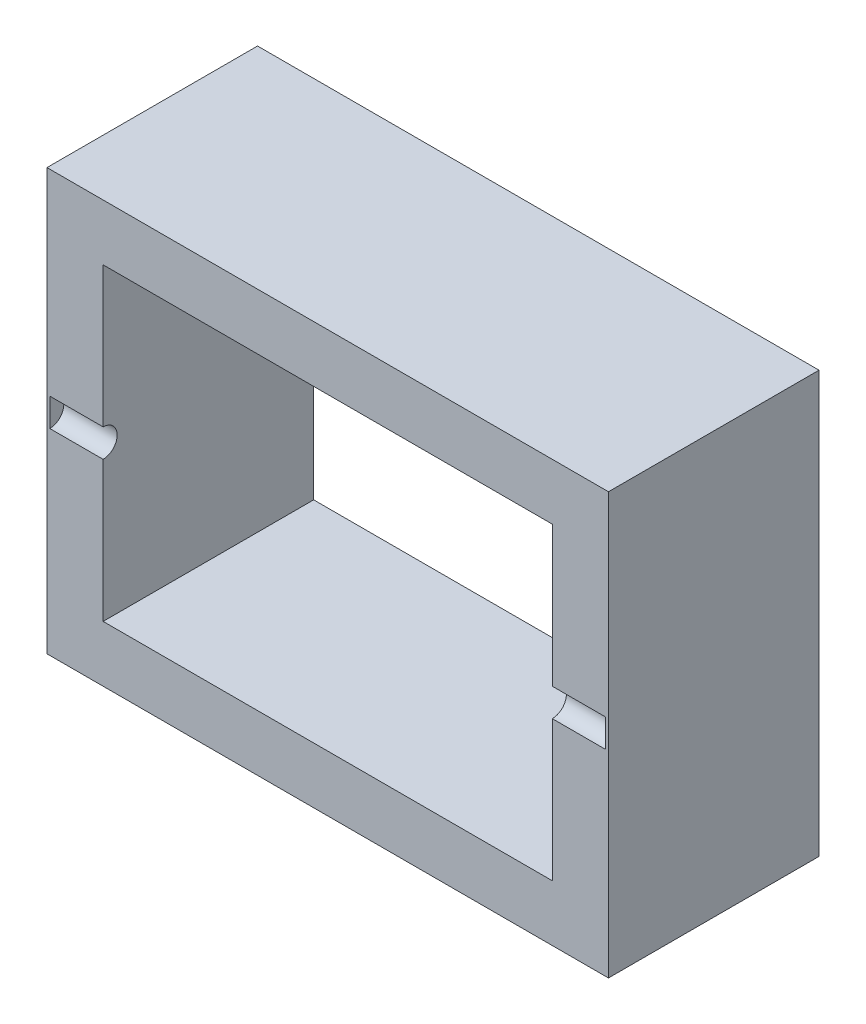
ISO-10303-21;
HEADER;
FILE_DESCRIPTION(('STEP AP214'),'2;1');
FILE_NAME('part.step','',(''),(''),'','','');
FILE_SCHEMA(('AUTOMOTIVE_DESIGN { 1 0 10303 214 1 1 1 1 }'));
ENDSEC;
DATA;
#1=APPLICATION_CONTEXT('core data for automotive mechanical design processes');
#2=APPLICATION_PROTOCOL_DEFINITION('international standard','automotive_design',2000,#1);
#3=PRODUCT_CONTEXT('',#1,'mechanical');
#4=PRODUCT('Part','Part','',(#3));
#5=PRODUCT_RELATED_PRODUCT_CATEGORY('part','',(#4));
#6=PRODUCT_DEFINITION_FORMATION('','',#4);
#7=PRODUCT_DEFINITION_CONTEXT('part definition',#1,'design');
#8=PRODUCT_DEFINITION('design','',#6,#7);
#9=PRODUCT_DEFINITION_SHAPE('','',#8);
#10=(LENGTH_UNIT() NAMED_UNIT(*) SI_UNIT(.MILLI.,.METRE.));
#11=(NAMED_UNIT(*) PLANE_ANGLE_UNIT() SI_UNIT($,.RADIAN.));
#12=(NAMED_UNIT(*) SI_UNIT($,.STERADIAN.) SOLID_ANGLE_UNIT());
#13=UNCERTAINTY_MEASURE_WITH_UNIT(LENGTH_MEASURE(1.E-05),#10,'distance_accuracy_value','');
#14=(GEOMETRIC_REPRESENTATION_CONTEXT(3) GLOBAL_UNCERTAINTY_ASSIGNED_CONTEXT((#13)) GLOBAL_UNIT_ASSIGNED_CONTEXT((#10,
#11,#12)) REPRESENTATION_CONTEXT('',''));
#15=CARTESIAN_POINT('',(0.,0.,0.));
#16=DIRECTION('',(0.,0.,1.));
#17=DIRECTION('',(1.,0.,0.));
#18=AXIS2_PLACEMENT_3D('',#15,#16,#17);
#19=CARTESIAN_POINT('',(39.6,0.,32.));
#20=DIRECTION('',(-1.,0.,0.));
#21=DIRECTION('',(0.,0.,1.));
#22=AXIS2_PLACEMENT_3D('',#19,#20,#21);
#23=PLANE('',#22);
#24=DIRECTION('',(0.,1.,0.));
#25=VECTOR('',#24,1.);
#26=CARTESIAN_POINT('',(39.6,30.,32.));
#27=LINE('',#26,#25);
#28=CARTESIAN_POINT('',(39.6,2.,32.));
#29=VERTEX_POINT('',#28);
#30=CARTESIAN_POINT('',(39.6,-2.,32.));
#31=VERTEX_POINT('',#30);
#32=EDGE_CURVE('E108',#29,#31,#27,.F.);
#33=ORIENTED_EDGE('',*,*,#32,.F.);
#34=CARTESIAN_POINT('',(39.6,0.,32.));
#35=DIRECTION('',(-1.,0.,0.));
#36=DIRECTION('',(0.,0.,1.));
#37=AXIS2_PLACEMENT_3D('',#34,#35,#36);
#38=CIRCLE('',#37,2.);
#39=EDGE_CURVE('E20',#29,#31,#38,.T.);
#40=ORIENTED_EDGE('',*,*,#39,.T.);
#41=EDGE_LOOP('',(#33,#40));
#42=FACE_BOUND('',#41,.T.);
#43=ADVANCED_FACE('F17',(#42),#23,.T.);
#44=CARTESIAN_POINT('',(39.6,0.,32.));
#45=DIRECTION('',(-1.,0.,0.));
#46=DIRECTION('',(0.,0.,1.));
#47=AXIS2_PLACEMENT_3D('',#44,#45,#46);
#48=CYLINDRICAL_SURFACE('',#47,2.);
#49=DIRECTION('',(1.,0.,0.));
#50=VECTOR('',#49,1.);
#51=CARTESIAN_POINT('',(40.,-2.,32.));
#52=LINE('',#51,#50);
#53=CARTESIAN_POINT('',(32.,-2.,32.));
#54=VERTEX_POINT('',#53);
#55=EDGE_CURVE('E112',#31,#54,#52,.F.);
#56=ORIENTED_EDGE('',*,*,#55,.F.);
#57=ORIENTED_EDGE('',*,*,#39,.F.);
#58=DIRECTION('',(1.,0.,0.));
#59=VECTOR('',#58,1.);
#60=CARTESIAN_POINT('',(40.,2.,32.));
#61=LINE('',#60,#59);
#62=CARTESIAN_POINT('',(32.,2.,32.));
#63=VERTEX_POINT('',#62);
#64=EDGE_CURVE('E124',#63,#29,#61,.T.);
#65=ORIENTED_EDGE('',*,*,#64,.F.);
#66=CARTESIAN_POINT('',(32.,0.,32.));
#67=DIRECTION('',(-1.,0.,0.));
#68=DIRECTION('',(0.,0.,1.));
#69=AXIS2_PLACEMENT_3D('',#66,#67,#68);
#70=CIRCLE('',#69,2.);
#71=EDGE_CURVE('E114',#63,#54,#70,.T.);
#72=ORIENTED_EDGE('',*,*,#71,.T.);
#73=EDGE_LOOP('',(#56,#57,#65,#72));
#74=FACE_BOUND('',#73,.T.);
#75=ADVANCED_FACE('F113',(#74),#48,.F.);
#76=CARTESIAN_POINT('',(-39.6,0.,32.));
#77=DIRECTION('',(-1.,0.,0.));
#78=DIRECTION('',(0.,0.,1.));
#79=AXIS2_PLACEMENT_3D('',#76,#77,#78);
#80=PLANE('',#79);
#81=DIRECTION('',(0.,1.,0.));
#82=VECTOR('',#81,1.);
#83=CARTESIAN_POINT('',(-39.6,30.,32.));
#84=LINE('',#83,#82);
#85=CARTESIAN_POINT('',(-39.6,-2.,32.));
#86=VERTEX_POINT('',#85);
#87=CARTESIAN_POINT('',(-39.6,2.,32.));
#88=VERTEX_POINT('',#87);
#89=EDGE_CURVE('E172',#86,#88,#84,.T.);
#90=ORIENTED_EDGE('',*,*,#89,.F.);
#91=CARTESIAN_POINT('',(-39.6,0.,32.));
#92=DIRECTION('',(-1.,0.,0.));
#93=DIRECTION('',(0.,0.,1.));
#94=AXIS2_PLACEMENT_3D('',#91,#92,#93);
#95=CIRCLE('',#94,2.);
#96=EDGE_CURVE('E110',#86,#88,#95,.F.);
#97=ORIENTED_EDGE('',*,*,#96,.T.);
#98=EDGE_LOOP('',(#90,#97));
#99=FACE_BOUND('',#98,.T.);
#100=ADVANCED_FACE('F170',(#99),#80,.F.);
#101=CARTESIAN_POINT('',(-32.,0.,32.));
#102=DIRECTION('',(-1.,0.,0.));
#103=DIRECTION('',(0.,0.,1.));
#104=AXIS2_PLACEMENT_3D('',#101,#102,#103);
#105=CYLINDRICAL_SURFACE('',#104,2.);
#106=CARTESIAN_POINT('',(-32.,0.,32.));
#107=DIRECTION('',(-1.,0.,0.));
#108=DIRECTION('',(0.,0.,1.));
#109=AXIS2_PLACEMENT_3D('',#106,#107,#108);
#110=CIRCLE('',#109,2.);
#111=CARTESIAN_POINT('',(-32.,2.,32.));
#112=VERTEX_POINT('',#111);
#113=CARTESIAN_POINT('',(-32.,-2.,32.));
#114=VERTEX_POINT('',#113);
#115=EDGE_CURVE('E164',#112,#114,#110,.T.);
#116=ORIENTED_EDGE('',*,*,#115,.F.);
#117=DIRECTION('',(1.,0.,0.));
#118=VECTOR('',#117,1.);
#119=CARTESIAN_POINT('',(40.,2.,32.));
#120=LINE('',#119,#118);
#121=EDGE_CURVE('E176',#88,#112,#120,.T.);
#122=ORIENTED_EDGE('',*,*,#121,.F.);
#123=ORIENTED_EDGE('',*,*,#96,.F.);
#124=DIRECTION('',(1.,0.,0.));
#125=VECTOR('',#124,1.);
#126=CARTESIAN_POINT('',(40.,-2.,32.));
#127=LINE('',#126,#125);
#128=EDGE_CURVE('E183',#114,#86,#127,.F.);
#129=ORIENTED_EDGE('',*,*,#128,.F.);
#130=EDGE_LOOP('',(#116,#122,#123,#129));
#131=FACE_BOUND('',#130,.T.);
#132=ADVANCED_FACE('F177',(#131),#105,.F.);
#133=CARTESIAN_POINT('',(-40.,30.,2.));
#134=DIRECTION('',(0.,1.,0.));
#135=DIRECTION('',(-1.,0.,0.));
#136=AXIS2_PLACEMENT_3D('',#133,#134,#135);
#137=PLANE('',#136);
#138=DIRECTION('',(0.,0.,1.));
#139=VECTOR('',#138,1.);
#140=CARTESIAN_POINT('',(40.,30.,2.));
#141=LINE('',#140,#139);
#142=CARTESIAN_POINT('',(40.,30.,32.));
#143=VERTEX_POINT('',#142);
#144=CARTESIAN_POINT('',(40.,30.,2.));
#145=VERTEX_POINT('',#144);
#146=EDGE_CURVE('E137',#143,#145,#141,.F.);
#147=ORIENTED_EDGE('',*,*,#146,.T.);
#148=DIRECTION('',(1.,0.,0.));
#149=VECTOR('',#148,1.);
#150=CARTESIAN_POINT('',(40.,30.,2.));
#151=LINE('',#150,#149);
#152=CARTESIAN_POINT('',(-40.,30.,2.));
#153=VERTEX_POINT('',#152);
#154=EDGE_CURVE('E242',#145,#153,#151,.F.);
#155=ORIENTED_EDGE('',*,*,#154,.T.);
#156=DIRECTION('',(0.,0.,1.));
#157=VECTOR('',#156,1.);
#158=CARTESIAN_POINT('',(-40.,30.,2.));
#159=LINE('',#158,#157);
#160=CARTESIAN_POINT('',(-40.,30.,32.));
#161=VERTEX_POINT('',#160);
#162=EDGE_CURVE('E225',#161,#153,#159,.F.);
#163=ORIENTED_EDGE('',*,*,#162,.F.);
#164=DIRECTION('',(1.,0.,0.));
#165=VECTOR('',#164,1.);
#166=CARTESIAN_POINT('',(40.,30.,32.));
#167=LINE('',#166,#165);
#168=EDGE_CURVE('E230',#143,#161,#167,.F.);
#169=ORIENTED_EDGE('',*,*,#168,.F.);
#170=EDGE_LOOP('',(#147,#155,#163,#169));
#171=FACE_BOUND('',#170,.T.);
#172=ADVANCED_FACE('F240',(#171),#137,.T.);
#173=CARTESIAN_POINT('',(32.,22.,2.));
#174=DIRECTION('',(1.,0.,0.));
#175=DIRECTION('',(0.,1.,0.));
#176=AXIS2_PLACEMENT_3D('',#173,#174,#175);
#177=PLANE('',#176);
#178=DIRECTION('',(0.,1.,0.));
#179=VECTOR('',#178,1.);
#180=CARTESIAN_POINT('',(32.,30.,32.));
#181=LINE('',#180,#179);
#182=CARTESIAN_POINT('',(32.,-22.,32.));
#183=VERTEX_POINT('',#182);
#184=EDGE_CURVE('E118',#54,#183,#181,.F.);
#185=ORIENTED_EDGE('',*,*,#184,.F.);
#186=ORIENTED_EDGE('',*,*,#71,.F.);
#187=DIRECTION('',(0.,1.,0.));
#188=VECTOR('',#187,1.);
#189=CARTESIAN_POINT('',(32.,30.,32.));
#190=LINE('',#189,#188);
#191=CARTESIAN_POINT('',(32.,22.,32.));
#192=VERTEX_POINT('',#191);
#193=EDGE_CURVE('E126',#192,#63,#190,.F.);
#194=ORIENTED_EDGE('',*,*,#193,.F.);
#195=DIRECTION('',(0.,0.,1.));
#196=VECTOR('',#195,1.);
#197=CARTESIAN_POINT('',(32.,22.,2.));
#198=LINE('',#197,#196);
#199=CARTESIAN_POINT('',(32.,22.,2.));
#200=VERTEX_POINT('',#199);
#201=EDGE_CURVE('E138',#200,#192,#198,.T.);
#202=ORIENTED_EDGE('',*,*,#201,.F.);
#203=DIRECTION('',(0.,1.,0.));
#204=VECTOR('',#203,1.);
#205=CARTESIAN_POINT('',(32.,30.,2.));
#206=LINE('',#205,#204);
#207=CARTESIAN_POINT('',(32.,-22.,2.));
#208=VERTEX_POINT('',#207);
#209=EDGE_CURVE('E156',#200,#208,#206,.F.);
#210=ORIENTED_EDGE('',*,*,#209,.T.);
#211=DIRECTION('',(0.,0.,1.));
#212=VECTOR('',#211,1.);
#213=CARTESIAN_POINT('',(32.,-22.,2.));
#214=LINE('',#213,#212);
#215=EDGE_CURVE('E166',#208,#183,#214,.T.);
#216=ORIENTED_EDGE('',*,*,#215,.T.);
#217=EDGE_LOOP('',(#185,#186,#194,#202,#210,#216));
#218=FACE_BOUND('',#217,.T.);
#219=ADVANCED_FACE('F209',(#218),#177,.F.);
#220=CARTESIAN_POINT('',(32.,-22.,2.));
#221=DIRECTION('',(0.,-1.,0.));
#222=DIRECTION('',(1.,0.,0.));
#223=AXIS2_PLACEMENT_3D('',#220,#221,#222);
#224=PLANE('',#223);
#225=DIRECTION('',(0.,0.,-1.));
#226=VECTOR('',#225,1.);
#227=CARTESIAN_POINT('',(-32.,-22.,2.));
#228=LINE('',#227,#226);
#229=CARTESIAN_POINT('',(-32.,-22.,32.));
#230=VERTEX_POINT('',#229);
#231=CARTESIAN_POINT('',(-32.,-22.,2.));
#232=VERTEX_POINT('',#231);
#233=EDGE_CURVE('E142',#230,#232,#228,.T.);
#234=ORIENTED_EDGE('',*,*,#233,.F.);
#235=DIRECTION('',(1.,0.,0.));
#236=VECTOR('',#235,1.);
#237=CARTESIAN_POINT('',(40.,-22.,32.));
#238=LINE('',#237,#236);
#239=EDGE_CURVE('E192',#183,#230,#238,.F.);
#240=ORIENTED_EDGE('',*,*,#239,.F.);
#241=ORIENTED_EDGE('',*,*,#215,.F.);
#242=DIRECTION('',(1.,0.,0.));
#243=VECTOR('',#242,1.);
#244=CARTESIAN_POINT('',(40.,-22.,2.));
#245=LINE('',#244,#243);
#246=EDGE_CURVE('E148',#208,#232,#245,.F.);
#247=ORIENTED_EDGE('',*,*,#246,.T.);
#248=EDGE_LOOP('',(#234,#240,#241,#247));
#249=FACE_BOUND('',#248,.T.);
#250=ADVANCED_FACE('F215',(#249),#224,.F.);
#251=CARTESIAN_POINT('',(-32.,22.,2.));
#252=DIRECTION('',(1.,0.,0.));
#253=DIRECTION('',(0.,0.,-1.));
#254=AXIS2_PLACEMENT_3D('',#251,#252,#253);
#255=PLANE('',#254);
#256=DIRECTION('',(0.,1.,0.));
#257=VECTOR('',#256,1.);
#258=CARTESIAN_POINT('',(-32.,30.,32.));
#259=LINE('',#258,#257);
#260=EDGE_CURVE('E185',#230,#114,#259,.T.);
#261=ORIENTED_EDGE('',*,*,#260,.F.);
#262=ORIENTED_EDGE('',*,*,#233,.T.);
#263=DIRECTION('',(0.,1.,0.));
#264=VECTOR('',#263,1.);
#265=CARTESIAN_POINT('',(-32.,30.,2.));
#266=LINE('',#265,#264);
#267=CARTESIAN_POINT('',(-32.,22.,2.));
#268=VERTEX_POINT('',#267);
#269=EDGE_CURVE('E145',#232,#268,#266,.T.);
#270=ORIENTED_EDGE('',*,*,#269,.T.);
#271=DIRECTION('',(0.,0.,1.));
#272=VECTOR('',#271,1.);
#273=CARTESIAN_POINT('',(-32.,22.,2.));
#274=LINE('',#273,#272);
#275=CARTESIAN_POINT('',(-32.,22.,32.));
#276=VERTEX_POINT('',#275);
#277=EDGE_CURVE('E134',#276,#268,#274,.F.);
#278=ORIENTED_EDGE('',*,*,#277,.F.);
#279=DIRECTION('',(0.,1.,0.));
#280=VECTOR('',#279,1.);
#281=CARTESIAN_POINT('',(-32.,30.,32.));
#282=LINE('',#281,#280);
#283=EDGE_CURVE('E180',#112,#276,#282,.T.);
#284=ORIENTED_EDGE('',*,*,#283,.F.);
#285=ORIENTED_EDGE('',*,*,#115,.T.);
#286=EDGE_LOOP('',(#261,#262,#270,#278,#284,#285));
#287=FACE_BOUND('',#286,.T.);
#288=ADVANCED_FACE('F219',(#287),#255,.T.);
#289=CARTESIAN_POINT('',(32.,22.,2.));
#290=DIRECTION('',(0.,-1.,0.));
#291=DIRECTION('',(1.,0.,0.));
#292=AXIS2_PLACEMENT_3D('',#289,#290,#291);
#293=PLANE('',#292);
#294=ORIENTED_EDGE('',*,*,#277,.T.);
#295=DIRECTION('',(1.,0.,0.));
#296=VECTOR('',#295,1.);
#297=CARTESIAN_POINT('',(40.,22.,2.));
#298=LINE('',#297,#296);
#299=EDGE_CURVE('E147',#268,#200,#298,.T.);
#300=ORIENTED_EDGE('',*,*,#299,.T.);
#301=ORIENTED_EDGE('',*,*,#201,.T.);
#302=DIRECTION('',(1.,0.,0.));
#303=VECTOR('',#302,1.);
#304=CARTESIAN_POINT('',(40.,22.,32.));
#305=LINE('',#304,#303);
#306=EDGE_CURVE('E131',#276,#192,#305,.T.);
#307=ORIENTED_EDGE('',*,*,#306,.F.);
#308=EDGE_LOOP('',(#294,#300,#301,#307));
#309=FACE_BOUND('',#308,.T.);
#310=ADVANCED_FACE('F270',(#309),#293,.T.);
#311=CARTESIAN_POINT('',(40.,-30.,2.));
#312=DIRECTION('',(-1.,0.,0.));
#313=DIRECTION('',(0.,-1.,0.));
#314=AXIS2_PLACEMENT_3D('',#311,#312,#313);
#315=PLANE('',#314);
#316=ORIENTED_EDGE('',*,*,#146,.F.);
#317=DIRECTION('',(0.,1.,0.));
#318=VECTOR('',#317,1.);
#319=CARTESIAN_POINT('',(40.,30.,32.));
#320=LINE('',#319,#318);
#321=CARTESIAN_POINT('',(40.,-30.,32.));
#322=VERTEX_POINT('',#321);
#323=EDGE_CURVE('E231',#322,#143,#320,.T.);
#324=ORIENTED_EDGE('',*,*,#323,.F.);
#325=DIRECTION('',(0.,0.,-1.));
#326=VECTOR('',#325,1.);
#327=CARTESIAN_POINT('',(40.,-30.,2.));
#328=LINE('',#327,#326);
#329=CARTESIAN_POINT('',(40.,-30.,2.));
#330=VERTEX_POINT('',#329);
#331=EDGE_CURVE('E153',#330,#322,#328,.F.);
#332=ORIENTED_EDGE('',*,*,#331,.F.);
#333=DIRECTION('',(0.,1.,0.));
#334=VECTOR('',#333,1.);
#335=CARTESIAN_POINT('',(40.,30.,2.));
#336=LINE('',#335,#334);
#337=EDGE_CURVE('E158',#330,#145,#336,.T.);
#338=ORIENTED_EDGE('',*,*,#337,.T.);
#339=EDGE_LOOP('',(#316,#324,#332,#338));
#340=FACE_BOUND('',#339,.T.);
#341=ADVANCED_FACE('F245',(#340),#315,.F.);
#342=CARTESIAN_POINT('',(40.,30.,32.));
#343=DIRECTION('',(0.,0.,1.));
#344=DIRECTION('',(1.,0.,0.));
#345=AXIS2_PLACEMENT_3D('',#342,#343,#344);
#346=PLANE('',#345);
#347=ORIENTED_EDGE('',*,*,#121,.T.);
#348=ORIENTED_EDGE('',*,*,#283,.T.);
#349=ORIENTED_EDGE('',*,*,#306,.T.);
#350=ORIENTED_EDGE('',*,*,#193,.T.);
#351=ORIENTED_EDGE('',*,*,#64,.T.);
#352=ORIENTED_EDGE('',*,*,#32,.T.);
#353=ORIENTED_EDGE('',*,*,#55,.T.);
#354=ORIENTED_EDGE('',*,*,#184,.T.);
#355=ORIENTED_EDGE('',*,*,#239,.T.);
#356=ORIENTED_EDGE('',*,*,#260,.T.);
#357=ORIENTED_EDGE('',*,*,#128,.T.);
#358=ORIENTED_EDGE('',*,*,#89,.T.);
#359=EDGE_LOOP('',(#347,#348,#349,#350,#351,#352,#353,#354,#355,#356,#357,#358));
#360=FACE_BOUND('',#359,.T.);
#361=DIRECTION('',(0.,1.,0.));
#362=VECTOR('',#361,1.);
#363=CARTESIAN_POINT('',(-40.,-30.,32.));
#364=LINE('',#363,#362);
#365=CARTESIAN_POINT('',(-40.,-30.,32.));
#366=VERTEX_POINT('',#365);
#367=EDGE_CURVE('E222',#366,#161,#364,.T.);
#368=ORIENTED_EDGE('',*,*,#367,.F.);
#369=DIRECTION('',(1.,0.,0.));
#370=VECTOR('',#369,1.);
#371=CARTESIAN_POINT('',(40.,-30.,32.));
#372=LINE('',#371,#370);
#373=EDGE_CURVE('E254',#322,#366,#372,.F.);
#374=ORIENTED_EDGE('',*,*,#373,.F.);
#375=ORIENTED_EDGE('',*,*,#323,.T.);
#376=ORIENTED_EDGE('',*,*,#168,.T.);
#377=EDGE_LOOP('',(#368,#374,#375,#376));
#378=FACE_BOUND('',#377,.T.);
#379=ADVANCED_FACE('F121',(#360,#378),#346,.T.);
#380=CARTESIAN_POINT('',(-40.,-30.,2.));
#381=DIRECTION('',(-1.,0.,0.));
#382=DIRECTION('',(0.,0.,1.));
#383=AXIS2_PLACEMENT_3D('',#380,#381,#382);
#384=PLANE('',#383);
#385=ORIENTED_EDGE('',*,*,#162,.T.);
#386=DIRECTION('',(0.,1.,0.));
#387=VECTOR('',#386,1.);
#388=CARTESIAN_POINT('',(-40.,30.,2.));
#389=LINE('',#388,#387);
#390=CARTESIAN_POINT('',(-40.,-30.,2.));
#391=VERTEX_POINT('',#390);
#392=EDGE_CURVE('E35',#153,#391,#389,.F.);
#393=ORIENTED_EDGE('',*,*,#392,.T.);
#394=DIRECTION('',(0.,0.,-1.));
#395=VECTOR('',#394,1.);
#396=CARTESIAN_POINT('',(-40.,-30.,2.));
#397=LINE('',#396,#395);
#398=EDGE_CURVE('E26',#366,#391,#397,.T.);
#399=ORIENTED_EDGE('',*,*,#398,.F.);
#400=ORIENTED_EDGE('',*,*,#367,.T.);
#401=EDGE_LOOP('',(#385,#393,#399,#400));
#402=FACE_BOUND('',#401,.T.);
#403=ADVANCED_FACE('F261',(#402),#384,.T.);
#404=CARTESIAN_POINT('',(40.,30.,2.));
#405=DIRECTION('',(0.,0.,1.));
#406=DIRECTION('',(1.,0.,0.));
#407=AXIS2_PLACEMENT_3D('',#404,#405,#406);
#408=PLANE('',#407);
#409=ORIENTED_EDGE('',*,*,#269,.F.);
#410=ORIENTED_EDGE('',*,*,#246,.F.);
#411=ORIENTED_EDGE('',*,*,#209,.F.);
#412=ORIENTED_EDGE('',*,*,#299,.F.);
#413=EDGE_LOOP('',(#409,#410,#411,#412));
#414=FACE_BOUND('',#413,.T.);
#415=DIRECTION('',(1.,0.,0.));
#416=VECTOR('',#415,1.);
#417=CARTESIAN_POINT('',(40.,-30.,2.));
#418=LINE('',#417,#416);
#419=EDGE_CURVE('E11',#391,#330,#418,.T.);
#420=ORIENTED_EDGE('',*,*,#419,.F.);
#421=ORIENTED_EDGE('',*,*,#392,.F.);
#422=ORIENTED_EDGE('',*,*,#154,.F.);
#423=ORIENTED_EDGE('',*,*,#337,.F.);
#424=EDGE_LOOP('',(#420,#421,#422,#423));
#425=FACE_BOUND('',#424,.T.);
#426=ADVANCED_FACE('F249',(#414,#425),#408,.F.);
#427=CARTESIAN_POINT('',(40.,-30.,2.));
#428=DIRECTION('',(0.,-1.,0.));
#429=DIRECTION('',(0.,0.,-1.));
#430=AXIS2_PLACEMENT_3D('',#427,#428,#429);
#431=PLANE('',#430);
#432=ORIENTED_EDGE('',*,*,#398,.T.);
#433=ORIENTED_EDGE('',*,*,#419,.T.);
#434=ORIENTED_EDGE('',*,*,#331,.T.);
#435=ORIENTED_EDGE('',*,*,#373,.T.);
#436=EDGE_LOOP('',(#432,#433,#434,#435));
#437=FACE_BOUND('',#436,.T.);
#438=ADVANCED_FACE('F259',(#437),#431,.T.);
#439=CLOSED_SHELL('',(#43,#75,#100,#132,#172,#219,#250,#288,#310,#341,#379,#403,#426,#438));
#440=MANIFOLD_SOLID_BREP('B1',#439);
#441=ADVANCED_BREP_SHAPE_REPRESENTATION('',(#18,#440),#14);
#442=SHAPE_DEFINITION_REPRESENTATION(#9,#441);
ENDSEC;
END-ISO-10303-21;
